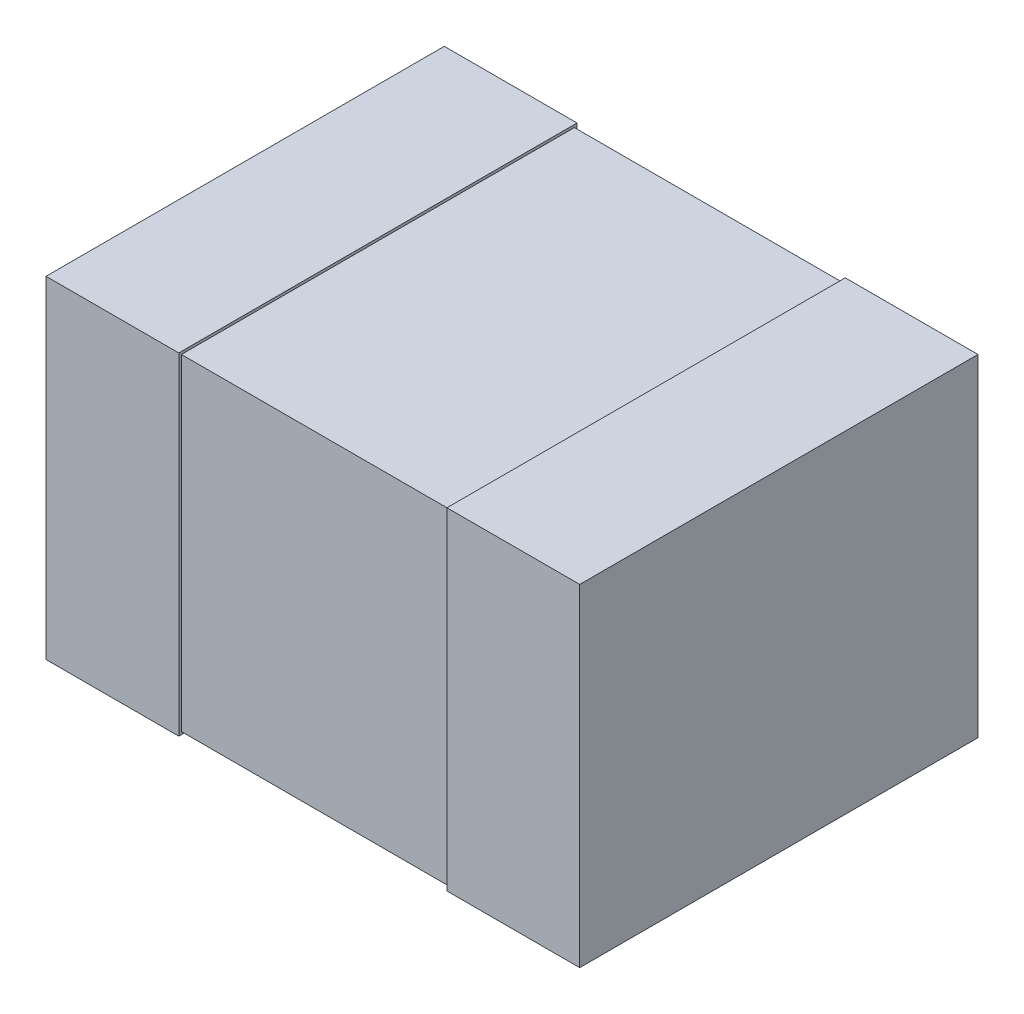
ISO-10303-21;
HEADER;
FILE_DESCRIPTION(('STEP AP214'),'2;1');
FILE_NAME('part.step','',(''),(''),'','','');
FILE_SCHEMA(('AUTOMOTIVE_DESIGN { 1 0 10303 214 1 1 1 1 }'));
ENDSEC;
DATA;
#1=APPLICATION_CONTEXT('core data for automotive mechanical design processes');
#2=APPLICATION_PROTOCOL_DEFINITION('international standard','automotive_design',2000,#1);
#3=PRODUCT_CONTEXT('',#1,'mechanical');
#4=PRODUCT('Part','Part','',(#3));
#5=PRODUCT_RELATED_PRODUCT_CATEGORY('part','',(#4));
#6=PRODUCT_DEFINITION_FORMATION('','',#4);
#7=PRODUCT_DEFINITION_CONTEXT('part definition',#1,'design');
#8=PRODUCT_DEFINITION('design','',#6,#7);
#9=PRODUCT_DEFINITION_SHAPE('','',#8);
#10=(LENGTH_UNIT() NAMED_UNIT(*) SI_UNIT(.MILLI.,.METRE.));
#11=(NAMED_UNIT(*) PLANE_ANGLE_UNIT() SI_UNIT($,.RADIAN.));
#12=(NAMED_UNIT(*) SI_UNIT($,.STERADIAN.) SOLID_ANGLE_UNIT());
#13=UNCERTAINTY_MEASURE_WITH_UNIT(LENGTH_MEASURE(1.E-05),#10,'distance_accuracy_value','');
#14=(GEOMETRIC_REPRESENTATION_CONTEXT(3) GLOBAL_UNCERTAINTY_ASSIGNED_CONTEXT((#13)) GLOBAL_UNIT_ASSIGNED_CONTEXT((#10,
#11,#12)) REPRESENTATION_CONTEXT('',''));
#15=CARTESIAN_POINT('',(0.,0.,0.));
#16=DIRECTION('',(0.,0.,1.));
#17=DIRECTION('',(1.,0.,0.));
#18=AXIS2_PLACEMENT_3D('',#15,#16,#17);
#19=CARTESIAN_POINT('',(1.005,-0.625,0.0762));
#20=DIRECTION('',(1.,0.,0.));
#21=DIRECTION('',(0.,1.,0.));
#22=AXIS2_PLACEMENT_3D('',#19,#20,#21);
#23=PLANE('',#22);
#24=DIRECTION('',(0.,1.,0.));
#25=VECTOR('',#24,1.);
#26=CARTESIAN_POINT('',(1.005,-0.625,0.0762));
#27=LINE('',#26,#25);
#28=CARTESIAN_POINT('',(1.005,-0.625,0.0762));
#29=VERTEX_POINT('',#28);
#30=CARTESIAN_POINT('',(1.005,0.625,0.0762));
#31=VERTEX_POINT('',#30);
#32=EDGE_CURVE('E170',#29,#31,#27,.T.);
#33=ORIENTED_EDGE('',*,*,#32,.T.);
#34=DIRECTION('',(0.,0.,1.));
#35=VECTOR('',#34,1.);
#36=CARTESIAN_POINT('',(1.005,0.625,0.0762));
#37=LINE('',#36,#35);
#38=CARTESIAN_POINT('',(1.005,0.625,1.5762));
#39=VERTEX_POINT('',#38);
#40=EDGE_CURVE('E211',#31,#39,#37,.T.);
#41=ORIENTED_EDGE('',*,*,#40,.T.);
#42=DIRECTION('',(0.,1.,0.));
#43=VECTOR('',#42,1.);
#44=CARTESIAN_POINT('',(1.005,-0.625,1.5762));
#45=LINE('',#44,#43);
#46=CARTESIAN_POINT('',(1.005,-0.625,1.5762));
#47=VERTEX_POINT('',#46);
#48=EDGE_CURVE('E20',#47,#39,#45,.T.);
#49=ORIENTED_EDGE('',*,*,#48,.F.);
#50=DIRECTION('',(0.,0.,1.));
#51=VECTOR('',#50,1.);
#52=CARTESIAN_POINT('',(1.005,-0.625,0.0762));
#53=LINE('',#52,#51);
#54=EDGE_CURVE('E11',#29,#47,#53,.T.);
#55=ORIENTED_EDGE('',*,*,#54,.F.);
#56=EDGE_LOOP('',(#33,#41,#49,#55));
#57=FACE_BOUND('',#56,.T.);
#58=ADVANCED_FACE('F16',(#57),#23,.T.);
#59=CARTESIAN_POINT('',(-1.005,0.625,0.0762));
#60=DIRECTION('',(-1.,0.,0.));
#61=DIRECTION('',(0.,0.,1.));
#62=AXIS2_PLACEMENT_3D('',#59,#60,#61);
#63=PLANE('',#62);
#64=DIRECTION('',(0.,-1.,0.));
#65=VECTOR('',#64,1.);
#66=CARTESIAN_POINT('',(-1.005,0.625,0.0762));
#67=LINE('',#66,#65);
#68=CARTESIAN_POINT('',(-1.005,0.625,0.0762));
#69=VERTEX_POINT('',#68);
#70=CARTESIAN_POINT('',(-1.005,-0.625,0.0762));
#71=VERTEX_POINT('',#70);
#72=EDGE_CURVE('E187',#69,#71,#67,.T.);
#73=ORIENTED_EDGE('',*,*,#72,.T.);
#74=DIRECTION('',(0.,0.,1.));
#75=VECTOR('',#74,1.);
#76=CARTESIAN_POINT('',(-1.005,-0.625,0.0762));
#77=LINE('',#76,#75);
#78=CARTESIAN_POINT('',(-1.005,-0.625,1.5762));
#79=VERTEX_POINT('',#78);
#80=EDGE_CURVE('E27',#71,#79,#77,.T.);
#81=ORIENTED_EDGE('',*,*,#80,.T.);
#82=DIRECTION('',(0.,-1.,0.));
#83=VECTOR('',#82,1.);
#84=CARTESIAN_POINT('',(-1.005,0.625,1.5762));
#85=LINE('',#84,#83);
#86=CARTESIAN_POINT('',(-1.005,0.625,1.5762));
#87=VERTEX_POINT('',#86);
#88=EDGE_CURVE('E207',#87,#79,#85,.T.);
#89=ORIENTED_EDGE('',*,*,#88,.F.);
#90=DIRECTION('',(0.,0.,1.));
#91=VECTOR('',#90,1.);
#92=CARTESIAN_POINT('',(-1.005,0.625,0.0762));
#93=LINE('',#92,#91);
#94=EDGE_CURVE('E225',#69,#87,#93,.T.);
#95=ORIENTED_EDGE('',*,*,#94,.F.);
#96=EDGE_LOOP('',(#73,#81,#89,#95));
#97=FACE_BOUND('',#96,.T.);
#98=ADVANCED_FACE('F302',(#97),#63,.T.);
#99=CARTESIAN_POINT('',(-1.005,-0.625,0.0762));
#100=DIRECTION('',(0.,-1.,0.));
#101=DIRECTION('',(0.,0.,-1.));
#102=AXIS2_PLACEMENT_3D('',#99,#100,#101);
#103=PLANE('',#102);
#104=DIRECTION('',(0.,0.,1.));
#105=VECTOR('',#104,1.);
#106=CARTESIAN_POINT('',(0.505,-0.625,0.0762));
#107=LINE('',#106,#105);
#108=CARTESIAN_POINT('',(0.505,-0.625,0.0762));
#109=VERTEX_POINT('',#108);
#110=CARTESIAN_POINT('',(0.505,-0.625,1.5762));
#111=VERTEX_POINT('',#110);
#112=EDGE_CURVE('E149',#109,#111,#107,.T.);
#113=ORIENTED_EDGE('',*,*,#112,.F.);
#114=DIRECTION('',(1.,0.,0.));
#115=VECTOR('',#114,1.);
#116=CARTESIAN_POINT('',(0.505,-0.625,0.0762));
#117=LINE('',#116,#115);
#118=EDGE_CURVE('E152',#109,#29,#117,.T.);
#119=ORIENTED_EDGE('',*,*,#118,.T.);
#120=ORIENTED_EDGE('',*,*,#54,.T.);
#121=DIRECTION('',(1.,0.,0.));
#122=VECTOR('',#121,1.);
#123=CARTESIAN_POINT('',(0.505,-0.625,1.5762));
#124=LINE('',#123,#122);
#125=EDGE_CURVE('E155',#111,#47,#124,.T.);
#126=ORIENTED_EDGE('',*,*,#125,.F.);
#127=EDGE_LOOP('',(#113,#119,#120,#126));
#128=FACE_BOUND('',#127,.T.);
#129=ADVANCED_FACE('F151',(#128),#103,.T.);
#130=CARTESIAN_POINT('',(-1.005,-0.625,0.0762));
#131=DIRECTION('',(0.,-1.,0.));
#132=DIRECTION('',(0.,0.,-1.));
#133=AXIS2_PLACEMENT_3D('',#130,#131,#132);
#134=PLANE('',#133);
#135=DIRECTION('',(0.,0.,1.));
#136=VECTOR('',#135,1.);
#137=CARTESIAN_POINT('',(-0.505,-0.625,0.0762));
#138=LINE('',#137,#136);
#139=CARTESIAN_POINT('',(-0.505,-0.625,0.0762));
#140=VERTEX_POINT('',#139);
#141=CARTESIAN_POINT('',(-0.505,-0.625,1.5762));
#142=VERTEX_POINT('',#141);
#143=EDGE_CURVE('E136',#140,#142,#138,.T.);
#144=ORIENTED_EDGE('',*,*,#143,.T.);
#145=DIRECTION('',(1.,0.,0.));
#146=VECTOR('',#145,1.);
#147=CARTESIAN_POINT('',(-1.005,-0.625,1.5762));
#148=LINE('',#147,#146);
#149=EDGE_CURVE('E74',#79,#142,#148,.T.);
#150=ORIENTED_EDGE('',*,*,#149,.F.);
#151=ORIENTED_EDGE('',*,*,#80,.F.);
#152=DIRECTION('',(1.,0.,0.));
#153=VECTOR('',#152,1.);
#154=CARTESIAN_POINT('',(-1.005,-0.625,0.0762));
#155=LINE('',#154,#153);
#156=EDGE_CURVE('E202',#71,#140,#155,.T.);
#157=ORIENTED_EDGE('',*,*,#156,.T.);
#158=EDGE_LOOP('',(#144,#150,#151,#157));
#159=FACE_BOUND('',#158,.T.);
#160=ADVANCED_FACE('F294',(#159),#134,.T.);
#161=CARTESIAN_POINT('',(0.,0.,1.5762));
#162=DIRECTION('',(0.,0.,1.));
#163=DIRECTION('',(1.,0.,0.));
#164=AXIS2_PLACEMENT_3D('',#161,#162,#163);
#165=PLANE('',#164);
#166=DIRECTION('',(0.,1.,0.));
#167=VECTOR('',#166,1.);
#168=CARTESIAN_POINT('',(0.505,-0.625,1.5762));
#169=LINE('',#168,#167);
#170=CARTESIAN_POINT('',(0.505,0.625,1.5762));
#171=VERTEX_POINT('',#170);
#172=EDGE_CURVE('E161',#111,#171,#169,.T.);
#173=ORIENTED_EDGE('',*,*,#172,.F.);
#174=ORIENTED_EDGE('',*,*,#125,.T.);
#175=ORIENTED_EDGE('',*,*,#48,.T.);
#176=DIRECTION('',(-1.,0.,0.));
#177=VECTOR('',#176,1.);
#178=CARTESIAN_POINT('',(1.005,0.625,1.5762));
#179=LINE('',#178,#177);
#180=EDGE_CURVE('E218',#39,#171,#179,.T.);
#181=ORIENTED_EDGE('',*,*,#180,.T.);
#182=EDGE_LOOP('',(#173,#174,#175,#181));
#183=FACE_BOUND('',#182,.T.);
#184=ADVANCED_FACE('F317',(#183),#165,.T.);
#185=CARTESIAN_POINT('',(0.,0.,1.5762));
#186=DIRECTION('',(0.,0.,1.));
#187=DIRECTION('',(1.,0.,0.));
#188=AXIS2_PLACEMENT_3D('',#185,#186,#187);
#189=PLANE('',#188);
#190=DIRECTION('',(0.,1.,0.));
#191=VECTOR('',#190,1.);
#192=CARTESIAN_POINT('',(-0.505,-0.625,1.5762));
#193=LINE('',#192,#191);
#194=CARTESIAN_POINT('',(-0.505,0.625,1.5762));
#195=VERTEX_POINT('',#194);
#196=EDGE_CURVE('E205',#142,#195,#193,.T.);
#197=ORIENTED_EDGE('',*,*,#196,.T.);
#198=DIRECTION('',(-1.,0.,0.));
#199=VECTOR('',#198,1.);
#200=CARTESIAN_POINT('',(-0.505,0.625,1.5762));
#201=LINE('',#200,#199);
#202=EDGE_CURVE('E89',#195,#87,#201,.T.);
#203=ORIENTED_EDGE('',*,*,#202,.T.);
#204=ORIENTED_EDGE('',*,*,#88,.T.);
#205=ORIENTED_EDGE('',*,*,#149,.T.);
#206=EDGE_LOOP('',(#197,#203,#204,#205));
#207=FACE_BOUND('',#206,.T.);
#208=ADVANCED_FACE('F299',(#207),#189,.T.);
#209=CARTESIAN_POINT('',(1.005,0.625,0.0762));
#210=DIRECTION('',(0.,1.,0.));
#211=DIRECTION('',(1.,0.,0.));
#212=AXIS2_PLACEMENT_3D('',#209,#210,#211);
#213=PLANE('',#212);
#214=DIRECTION('',(0.,0.,1.));
#215=VECTOR('',#214,1.);
#216=CARTESIAN_POINT('',(0.505,0.625,0.0762));
#217=LINE('',#216,#215);
#218=CARTESIAN_POINT('',(0.505,0.625,0.0762));
#219=VERTEX_POINT('',#218);
#220=EDGE_CURVE('E175',#219,#171,#217,.T.);
#221=ORIENTED_EDGE('',*,*,#220,.T.);
#222=ORIENTED_EDGE('',*,*,#180,.F.);
#223=ORIENTED_EDGE('',*,*,#40,.F.);
#224=DIRECTION('',(-1.,0.,0.));
#225=VECTOR('',#224,1.);
#226=CARTESIAN_POINT('',(1.005,0.625,0.0762));
#227=LINE('',#226,#225);
#228=EDGE_CURVE('E178',#31,#219,#227,.T.);
#229=ORIENTED_EDGE('',*,*,#228,.T.);
#230=EDGE_LOOP('',(#221,#222,#223,#229));
#231=FACE_BOUND('',#230,.T.);
#232=ADVANCED_FACE('F330',(#231),#213,.T.);
#233=CARTESIAN_POINT('',(1.005,0.625,0.0762));
#234=DIRECTION('',(0.,1.,0.));
#235=DIRECTION('',(1.,0.,0.));
#236=AXIS2_PLACEMENT_3D('',#233,#234,#235);
#237=PLANE('',#236);
#238=DIRECTION('',(0.,0.,1.));
#239=VECTOR('',#238,1.);
#240=CARTESIAN_POINT('',(-0.505,0.625,0.0762));
#241=LINE('',#240,#239);
#242=CARTESIAN_POINT('',(-0.505,0.625,0.0762));
#243=VERTEX_POINT('',#242);
#244=EDGE_CURVE('E127',#243,#195,#241,.T.);
#245=ORIENTED_EDGE('',*,*,#244,.F.);
#246=DIRECTION('',(-1.,0.,0.));
#247=VECTOR('',#246,1.);
#248=CARTESIAN_POINT('',(-0.505,0.625,0.0762));
#249=LINE('',#248,#247);
#250=EDGE_CURVE('E179',#243,#69,#249,.T.);
#251=ORIENTED_EDGE('',*,*,#250,.T.);
#252=ORIENTED_EDGE('',*,*,#94,.T.);
#253=ORIENTED_EDGE('',*,*,#202,.F.);
#254=EDGE_LOOP('',(#245,#251,#252,#253));
#255=FACE_BOUND('',#254,.T.);
#256=ADVANCED_FACE('F300',(#255),#237,.T.);
#257=CARTESIAN_POINT('',(0.505,-0.625,0.0862));
#258=DIRECTION('',(1.,0.,0.));
#259=DIRECTION('',(0.,1.,0.));
#260=AXIS2_PLACEMENT_3D('',#257,#258,#259);
#261=PLANE('',#260);
#262=DIRECTION('',(0.,1.,0.));
#263=VECTOR('',#262,1.);
#264=CARTESIAN_POINT('',(0.505,-0.615,0.0862));
#265=LINE('',#264,#263);
#266=CARTESIAN_POINT('',(0.505,-0.615,0.0862));
#267=VERTEX_POINT('',#266);
#268=CARTESIAN_POINT('',(0.505,0.615,0.0862));
#269=VERTEX_POINT('',#268);
#270=EDGE_CURVE('E162',#267,#269,#265,.T.);
#271=ORIENTED_EDGE('',*,*,#270,.T.);
#272=DIRECTION('',(0.,0.,1.));
#273=VECTOR('',#272,1.);
#274=CARTESIAN_POINT('',(0.505,0.615,0.0862));
#275=LINE('',#274,#273);
#276=CARTESIAN_POINT('',(0.505,0.615,1.5662));
#277=VERTEX_POINT('',#276);
#278=EDGE_CURVE('E197',#269,#277,#275,.T.);
#279=ORIENTED_EDGE('',*,*,#278,.T.);
#280=DIRECTION('',(0.,-1.,0.));
#281=VECTOR('',#280,1.);
#282=CARTESIAN_POINT('',(0.505,0.615,1.5662));
#283=LINE('',#282,#281);
#284=CARTESIAN_POINT('',(0.505,-0.615,1.5662));
#285=VERTEX_POINT('',#284);
#286=EDGE_CURVE('E198',#277,#285,#283,.T.);
#287=ORIENTED_EDGE('',*,*,#286,.T.);
#288=DIRECTION('',(0.,0.,-1.));
#289=VECTOR('',#288,1.);
#290=CARTESIAN_POINT('',(0.505,-0.615,1.5662));
#291=LINE('',#290,#289);
#292=EDGE_CURVE('E238',#285,#267,#291,.T.);
#293=ORIENTED_EDGE('',*,*,#292,.T.);
#294=EDGE_LOOP('',(#271,#279,#287,#293));
#295=FACE_BOUND('',#294,.T.);
#296=DIRECTION('',(0.,1.,0.));
#297=VECTOR('',#296,1.);
#298=CARTESIAN_POINT('',(0.505,-0.625,0.0762));
#299=LINE('',#298,#297);
#300=EDGE_CURVE('E168',#109,#219,#299,.T.);
#301=ORIENTED_EDGE('',*,*,#300,.F.);
#302=ORIENTED_EDGE('',*,*,#112,.T.);
#303=ORIENTED_EDGE('',*,*,#172,.T.);
#304=ORIENTED_EDGE('',*,*,#220,.F.);
#305=EDGE_LOOP('',(#301,#302,#303,#304));
#306=FACE_BOUND('',#305,.T.);
#307=ADVANCED_FACE('F173',(#295,#306),#261,.F.);
#308=CARTESIAN_POINT('',(-0.505,-0.625,0.0862));
#309=DIRECTION('',(0.,0.,1.));
#310=DIRECTION('',(1.,0.,0.));
#311=AXIS2_PLACEMENT_3D('',#308,#309,#310);
#312=PLANE('',#311);
#313=DIRECTION('',(1.,0.,0.));
#314=VECTOR('',#313,1.);
#315=CARTESIAN_POINT('',(-0.505,-0.615,0.0862));
#316=LINE('',#315,#314);
#317=CARTESIAN_POINT('',(-0.505,-0.615,0.0862));
#318=VERTEX_POINT('',#317);
#319=EDGE_CURVE('E235',#318,#267,#316,.T.);
#320=ORIENTED_EDGE('',*,*,#319,.F.);
#321=DIRECTION('',(0.,1.,0.));
#322=VECTOR('',#321,1.);
#323=CARTESIAN_POINT('',(-0.505,-0.615,0.0862));
#324=LINE('',#323,#322);
#325=CARTESIAN_POINT('',(-0.505,0.615,0.0862));
#326=VERTEX_POINT('',#325);
#327=EDGE_CURVE('E226',#318,#326,#324,.T.);
#328=ORIENTED_EDGE('',*,*,#327,.T.);
#329=DIRECTION('',(1.,0.,0.));
#330=VECTOR('',#329,1.);
#331=CARTESIAN_POINT('',(-0.505,0.615,0.0862));
#332=LINE('',#331,#330);
#333=EDGE_CURVE('E193',#326,#269,#332,.T.);
#334=ORIENTED_EDGE('',*,*,#333,.T.);
#335=ORIENTED_EDGE('',*,*,#270,.F.);
#336=EDGE_LOOP('',(#320,#328,#334,#335));
#337=FACE_BOUND('',#336,.T.);
#338=ADVANCED_FACE('F318',(#337),#312,.F.);
#339=CARTESIAN_POINT('',(-0.505,0.615,0.0762));
#340=DIRECTION('',(0.,-1.,0.));
#341=DIRECTION('',(0.,0.,-1.));
#342=AXIS2_PLACEMENT_3D('',#339,#340,#341);
#343=PLANE('',#342);
#344=ORIENTED_EDGE('',*,*,#333,.F.);
#345=DIRECTION('',(0.,0.,1.));
#346=VECTOR('',#345,1.);
#347=CARTESIAN_POINT('',(-0.505,0.615,0.0862));
#348=LINE('',#347,#346);
#349=CARTESIAN_POINT('',(-0.505,0.615,1.5662));
#350=VERTEX_POINT('',#349);
#351=EDGE_CURVE('E231',#326,#350,#348,.T.);
#352=ORIENTED_EDGE('',*,*,#351,.T.);
#353=DIRECTION('',(1.,0.,0.));
#354=VECTOR('',#353,1.);
#355=CARTESIAN_POINT('',(-0.505,0.615,1.5662));
#356=LINE('',#355,#354);
#357=EDGE_CURVE('E234',#350,#277,#356,.T.);
#358=ORIENTED_EDGE('',*,*,#357,.T.);
#359=ORIENTED_EDGE('',*,*,#278,.F.);
#360=EDGE_LOOP('',(#344,#352,#358,#359));
#361=FACE_BOUND('',#360,.T.);
#362=ADVANCED_FACE('F321',(#361),#343,.F.);
#363=CARTESIAN_POINT('',(-0.505,0.625,1.5662));
#364=DIRECTION('',(0.,0.,-1.));
#365=DIRECTION('',(0.,-1.,0.));
#366=AXIS2_PLACEMENT_3D('',#363,#364,#365);
#367=PLANE('',#366);
#368=ORIENTED_EDGE('',*,*,#357,.F.);
#369=DIRECTION('',(0.,-1.,0.));
#370=VECTOR('',#369,1.);
#371=CARTESIAN_POINT('',(-0.505,0.615,1.5662));
#372=LINE('',#371,#370);
#373=CARTESIAN_POINT('',(-0.505,-0.615,1.5662));
#374=VERTEX_POINT('',#373);
#375=EDGE_CURVE('E254',#350,#374,#372,.T.);
#376=ORIENTED_EDGE('',*,*,#375,.T.);
#377=DIRECTION('',(1.,0.,0.));
#378=VECTOR('',#377,1.);
#379=CARTESIAN_POINT('',(-0.505,-0.615,1.5662));
#380=LINE('',#379,#378);
#381=EDGE_CURVE('E230',#374,#285,#380,.T.);
#382=ORIENTED_EDGE('',*,*,#381,.T.);
#383=ORIENTED_EDGE('',*,*,#286,.F.);
#384=EDGE_LOOP('',(#368,#376,#382,#383));
#385=FACE_BOUND('',#384,.T.);
#386=ADVANCED_FACE('F18',(#385),#367,.F.);
#387=CARTESIAN_POINT('',(-0.505,-0.615,1.5762));
#388=DIRECTION('',(0.,1.,0.));
#389=DIRECTION('',(1.,0.,0.));
#390=AXIS2_PLACEMENT_3D('',#387,#388,#389);
#391=PLANE('',#390);
#392=ORIENTED_EDGE('',*,*,#381,.F.);
#393=DIRECTION('',(0.,0.,-1.));
#394=VECTOR('',#393,1.);
#395=CARTESIAN_POINT('',(-0.505,-0.615,1.5662));
#396=LINE('',#395,#394);
#397=EDGE_CURVE('E204',#374,#318,#396,.T.);
#398=ORIENTED_EDGE('',*,*,#397,.T.);
#399=ORIENTED_EDGE('',*,*,#319,.T.);
#400=ORIENTED_EDGE('',*,*,#292,.F.);
#401=EDGE_LOOP('',(#392,#398,#399,#400));
#402=FACE_BOUND('',#401,.T.);
#403=ADVANCED_FACE('F259',(#402),#391,.F.);
#404=CARTESIAN_POINT('',(-0.505,-0.625,0.0762));
#405=DIRECTION('',(-1.,0.,0.));
#406=DIRECTION('',(0.,0.,1.));
#407=AXIS2_PLACEMENT_3D('',#404,#405,#406);
#408=PLANE('',#407);
#409=ORIENTED_EDGE('',*,*,#397,.F.);
#410=ORIENTED_EDGE('',*,*,#375,.F.);
#411=ORIENTED_EDGE('',*,*,#351,.F.);
#412=ORIENTED_EDGE('',*,*,#327,.F.);
#413=EDGE_LOOP('',(#409,#410,#411,#412));
#414=FACE_BOUND('',#413,.T.);
#415=DIRECTION('',(0.,1.,0.));
#416=VECTOR('',#415,1.);
#417=CARTESIAN_POINT('',(-0.505,-0.625,0.0762));
#418=LINE('',#417,#416);
#419=EDGE_CURVE('E271',#140,#243,#418,.T.);
#420=ORIENTED_EDGE('',*,*,#419,.T.);
#421=ORIENTED_EDGE('',*,*,#244,.T.);
#422=ORIENTED_EDGE('',*,*,#196,.F.);
#423=ORIENTED_EDGE('',*,*,#143,.F.);
#424=EDGE_LOOP('',(#420,#421,#422,#423));
#425=FACE_BOUND('',#424,.T.);
#426=ADVANCED_FACE('F298',(#414,#425),#408,.F.);
#427=CARTESIAN_POINT('',(0.,0.,0.0762));
#428=DIRECTION('',(0.,0.,1.));
#429=DIRECTION('',(1.,0.,0.));
#430=AXIS2_PLACEMENT_3D('',#427,#428,#429);
#431=PLANE('',#430);
#432=ORIENTED_EDGE('',*,*,#300,.T.);
#433=ORIENTED_EDGE('',*,*,#228,.F.);
#434=ORIENTED_EDGE('',*,*,#32,.F.);
#435=ORIENTED_EDGE('',*,*,#118,.F.);
#436=EDGE_LOOP('',(#432,#433,#434,#435));
#437=FACE_BOUND('',#436,.T.);
#438=ADVANCED_FACE('F166',(#437),#431,.F.);
#439=CARTESIAN_POINT('',(0.,0.,0.0762));
#440=DIRECTION('',(0.,0.,1.));
#441=DIRECTION('',(1.,0.,0.));
#442=AXIS2_PLACEMENT_3D('',#439,#440,#441);
#443=PLANE('',#442);
#444=ORIENTED_EDGE('',*,*,#419,.F.);
#445=ORIENTED_EDGE('',*,*,#156,.F.);
#446=ORIENTED_EDGE('',*,*,#72,.F.);
#447=ORIENTED_EDGE('',*,*,#250,.F.);
#448=EDGE_LOOP('',(#444,#445,#446,#447));
#449=FACE_BOUND('',#448,.T.);
#450=ADVANCED_FACE('F297',(#449),#443,.F.);
#451=CLOSED_SHELL('',(#58,#98,#129,#160,#184,#208,#232,#256,#307,#338,#362,#386,#403,#426,#438,#450));
#452=MANIFOLD_SOLID_BREP('B1',#451);
#453=ADVANCED_BREP_SHAPE_REPRESENTATION('',(#18,#452),#14);
#454=SHAPE_DEFINITION_REPRESENTATION(#9,#453);
ENDSEC;
END-ISO-10303-21;
